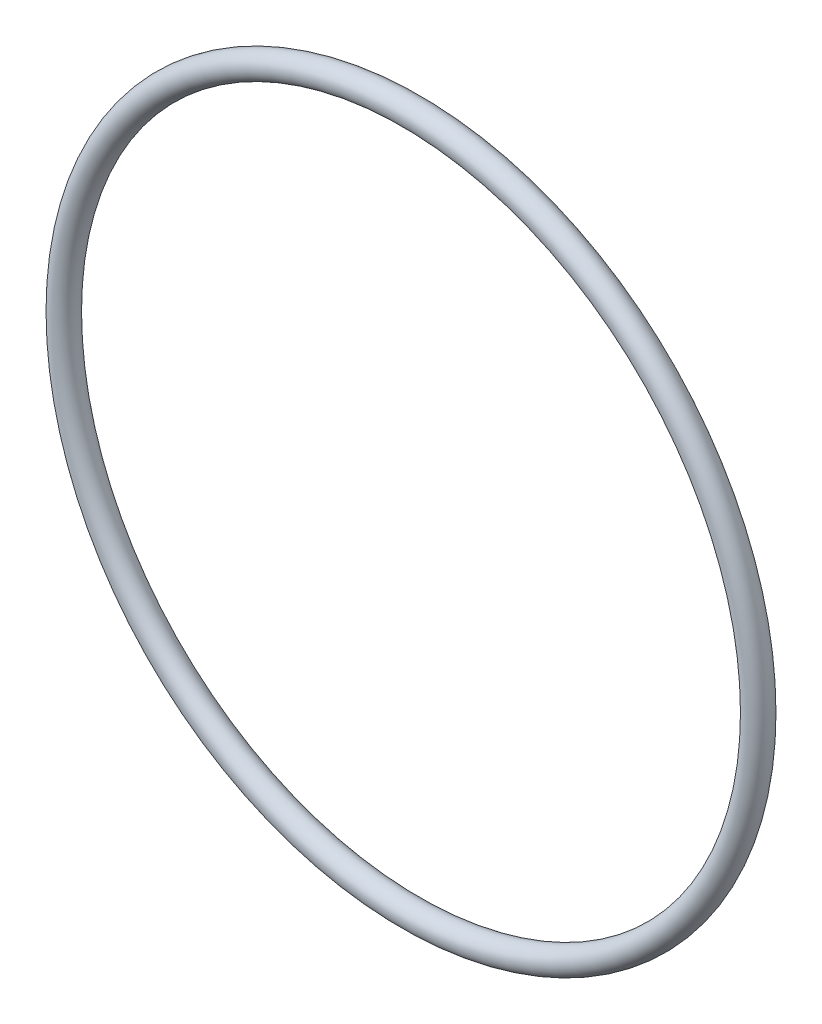
ISO-10303-21;
HEADER;
FILE_DESCRIPTION(('STEP AP214'),'2;1');
FILE_NAME('part.step','',(''),(''),'','','');
FILE_SCHEMA(('AUTOMOTIVE_DESIGN { 1 0 10303 214 1 1 1 1 }'));
ENDSEC;
DATA;
#1=APPLICATION_CONTEXT('core data for automotive mechanical design processes');
#2=APPLICATION_PROTOCOL_DEFINITION('international standard','automotive_design',2000,#1);
#3=PRODUCT_CONTEXT('',#1,'mechanical');
#4=PRODUCT('Part','Part','',(#3));
#5=PRODUCT_RELATED_PRODUCT_CATEGORY('part','',(#4));
#6=PRODUCT_DEFINITION_FORMATION('','',#4);
#7=PRODUCT_DEFINITION_CONTEXT('part definition',#1,'design');
#8=PRODUCT_DEFINITION('design','',#6,#7);
#9=PRODUCT_DEFINITION_SHAPE('','',#8);
#10=(LENGTH_UNIT() NAMED_UNIT(*) SI_UNIT(.MILLI.,.METRE.));
#11=(NAMED_UNIT(*) PLANE_ANGLE_UNIT() SI_UNIT($,.RADIAN.));
#12=(NAMED_UNIT(*) SI_UNIT($,.STERADIAN.) SOLID_ANGLE_UNIT());
#13=UNCERTAINTY_MEASURE_WITH_UNIT(LENGTH_MEASURE(1.E-05),#10,'distance_accuracy_value','');
#14=(GEOMETRIC_REPRESENTATION_CONTEXT(3) GLOBAL_UNCERTAINTY_ASSIGNED_CONTEXT((#13)) GLOBAL_UNIT_ASSIGNED_CONTEXT((#10,
#11,#12)) REPRESENTATION_CONTEXT('',''));
#15=CARTESIAN_POINT('',(0.,0.,0.));
#16=DIRECTION('',(0.,0.,1.));
#17=DIRECTION('',(1.,0.,0.));
#18=AXIS2_PLACEMENT_3D('',#15,#16,#17);
#19=CARTESIAN_POINT('',(0.,0.,0.));
#20=DIRECTION('',(0.,0.,1.));
#21=DIRECTION('',(1.,0.,0.));
#22=AXIS2_PLACEMENT_3D('',#19,#20,#21);
#23=TOROIDAL_SURFACE('',#22,24.5618,0.888999999999996);
#24=CARTESIAN_POINT('',(25.4508,0.,0.));
#25=VERTEX_POINT('',#24);
#26=VERTEX_LOOP('',#25);
#27=FACE_BOUND('',#26,.T.);
#28=ADVANCED_FACE('F30',(#27),#23,.T.);
#29=CLOSED_SHELL('',(#28));
#30=MANIFOLD_SOLID_BREP('B2',#29);
#31=ADVANCED_BREP_SHAPE_REPRESENTATION('',(#18,#30),#14);
#32=SHAPE_DEFINITION_REPRESENTATION(#9,#31);
ENDSEC;
END-ISO-10303-21;
